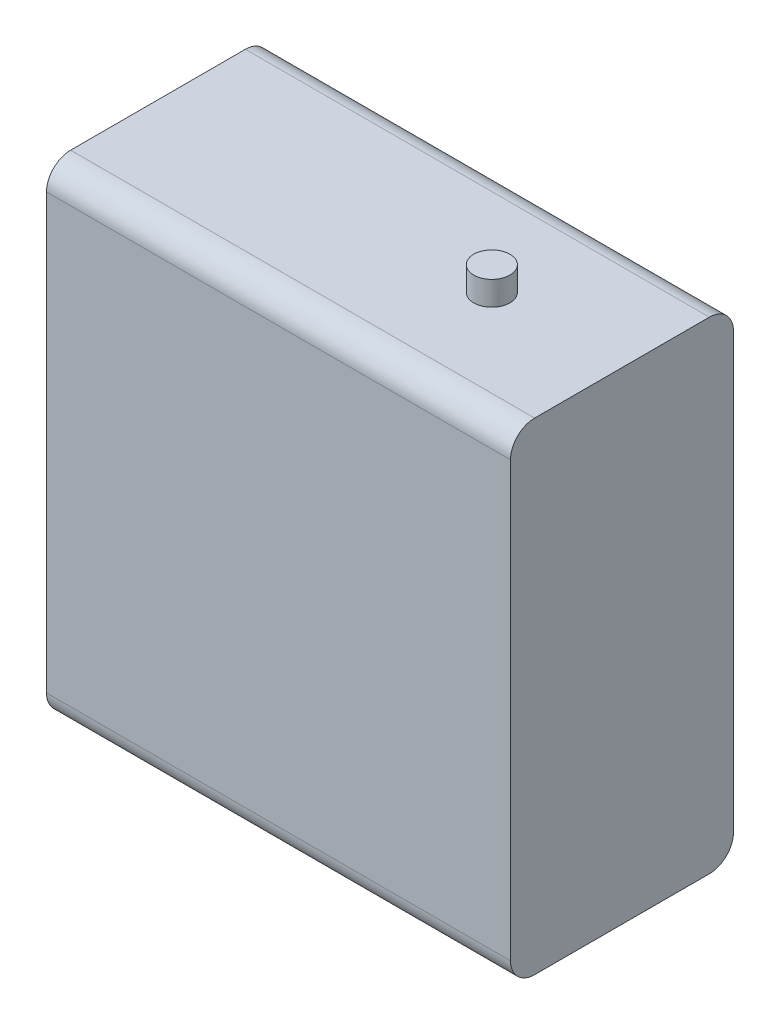
ISO-10303-21;
HEADER;
FILE_DESCRIPTION(('STEP AP214'),'2;1');
FILE_NAME('part.step','',(''),(''),'','','');
FILE_SCHEMA(('AUTOMOTIVE_DESIGN { 1 0 10303 214 1 1 1 1 }'));
ENDSEC;
DATA;
#1=APPLICATION_CONTEXT('core data for automotive mechanical design processes');
#2=APPLICATION_PROTOCOL_DEFINITION('international standard','automotive_design',2000,#1);
#3=PRODUCT_CONTEXT('',#1,'mechanical');
#4=PRODUCT('Part','Part','',(#3));
#5=PRODUCT_RELATED_PRODUCT_CATEGORY('part','',(#4));
#6=PRODUCT_DEFINITION_FORMATION('','',#4);
#7=PRODUCT_DEFINITION_CONTEXT('part definition',#1,'design');
#8=PRODUCT_DEFINITION('design','',#6,#7);
#9=PRODUCT_DEFINITION_SHAPE('','',#8);
#10=(LENGTH_UNIT() NAMED_UNIT(*) SI_UNIT(.MILLI.,.METRE.));
#11=(NAMED_UNIT(*) PLANE_ANGLE_UNIT() SI_UNIT($,.RADIAN.));
#12=(NAMED_UNIT(*) SI_UNIT($,.STERADIAN.) SOLID_ANGLE_UNIT());
#13=UNCERTAINTY_MEASURE_WITH_UNIT(LENGTH_MEASURE(1.E-05),#10,'distance_accuracy_value','');
#14=(GEOMETRIC_REPRESENTATION_CONTEXT(3) GLOBAL_UNCERTAINTY_ASSIGNED_CONTEXT((#13)) GLOBAL_UNIT_ASSIGNED_CONTEXT((#10,
#11,#12)) REPRESENTATION_CONTEXT('',''));
#15=CARTESIAN_POINT('',(0.,0.,0.));
#16=DIRECTION('',(0.,0.,1.));
#17=DIRECTION('',(1.,0.,0.));
#18=AXIS2_PLACEMENT_3D('',#15,#16,#17);
#19=CARTESIAN_POINT('',(0.,0.,18.5));
#20=DIRECTION('',(1.,0.,0.));
#21=DIRECTION('',(0.,0.,-1.));
#22=AXIS2_PLACEMENT_3D('',#19,#20,#21);
#23=PLANE('',#22);
#24=DIRECTION('',(0.,-1.,0.));
#25=VECTOR('',#24,1.);
#26=CARTESIAN_POINT('',(0.,0.,0.));
#27=LINE('',#26,#25);
#28=CARTESIAN_POINT('',(0.,38.,0.));
#29=VERTEX_POINT('',#28);
#30=CARTESIAN_POINT('',(0.,2.,0.));
#31=VERTEX_POINT('',#30);
#32=EDGE_CURVE('E173',#29,#31,#27,.T.);
#33=ORIENTED_EDGE('',*,*,#32,.T.);
#34=CARTESIAN_POINT('',(0.,2.,2.));
#35=DIRECTION('',(1.,0.,0.));
#36=DIRECTION('',(0.,0.,-1.));
#37=AXIS2_PLACEMENT_3D('',#34,#35,#36);
#38=CIRCLE('',#37,2.);
#39=CARTESIAN_POINT('',(0.,0.,2.));
#40=VERTEX_POINT('',#39);
#41=EDGE_CURVE('E144',#31,#40,#38,.F.);
#42=ORIENTED_EDGE('',*,*,#41,.T.);
#43=DIRECTION('',(0.,0.,-1.));
#44=VECTOR('',#43,1.);
#45=CARTESIAN_POINT('',(0.,0.,18.5));
#46=LINE('',#45,#44);
#47=CARTESIAN_POINT('',(0.,0.,16.5));
#48=VERTEX_POINT('',#47);
#49=EDGE_CURVE('E123',#48,#40,#46,.T.);
#50=ORIENTED_EDGE('',*,*,#49,.F.);
#51=CARTESIAN_POINT('',(0.,2.,16.5));
#52=DIRECTION('',(1.,0.,0.));
#53=DIRECTION('',(0.,0.,-1.));
#54=AXIS2_PLACEMENT_3D('',#51,#52,#53);
#55=CIRCLE('',#54,2.);
#56=CARTESIAN_POINT('',(0.,2.,18.5));
#57=VERTEX_POINT('',#56);
#58=EDGE_CURVE('E128',#48,#57,#55,.F.);
#59=ORIENTED_EDGE('',*,*,#58,.T.);
#60=DIRECTION('',(0.,-1.,0.));
#61=VECTOR('',#60,1.);
#62=CARTESIAN_POINT('',(0.,0.,18.5));
#63=LINE('',#62,#61);
#64=CARTESIAN_POINT('',(0.,38.,18.5));
#65=VERTEX_POINT('',#64);
#66=EDGE_CURVE('E168',#65,#57,#63,.T.);
#67=ORIENTED_EDGE('',*,*,#66,.F.);
#68=CARTESIAN_POINT('',(0.,38.,16.5));
#69=DIRECTION('',(1.,0.,0.));
#70=DIRECTION('',(0.,0.,-1.));
#71=AXIS2_PLACEMENT_3D('',#68,#69,#70);
#72=CIRCLE('',#71,2.);
#73=CARTESIAN_POINT('',(0.,40.,16.5));
#74=VERTEX_POINT('',#73);
#75=EDGE_CURVE('E58',#65,#74,#72,.F.);
#76=ORIENTED_EDGE('',*,*,#75,.T.);
#77=DIRECTION('',(0.,0.,-1.));
#78=VECTOR('',#77,1.);
#79=CARTESIAN_POINT('',(0.,40.,18.5));
#80=LINE('',#79,#78);
#81=CARTESIAN_POINT('',(0.,40.,2.));
#82=VERTEX_POINT('',#81);
#83=EDGE_CURVE('E157',#74,#82,#80,.T.);
#84=ORIENTED_EDGE('',*,*,#83,.T.);
#85=CARTESIAN_POINT('',(0.,38.,2.));
#86=DIRECTION('',(1.,0.,0.));
#87=DIRECTION('',(0.,0.,-1.));
#88=AXIS2_PLACEMENT_3D('',#85,#86,#87);
#89=CIRCLE('',#88,2.);
#90=EDGE_CURVE('E50',#82,#29,#89,.F.);
#91=ORIENTED_EDGE('',*,*,#90,.T.);
#92=EDGE_LOOP('',(#33,#42,#50,#59,#67,#76,#84,#91));
#93=FACE_BOUND('',#92,.T.);
#94=ADVANCED_FACE('F35',(#93),#23,.F.);
#95=CARTESIAN_POINT('',(0.,0.,18.5));
#96=DIRECTION('',(0.,1.,0.));
#97=DIRECTION('',(0.,0.,1.));
#98=AXIS2_PLACEMENT_3D('',#95,#96,#97);
#99=PLANE('',#98);
#100=ORIENTED_EDGE('',*,*,#49,.T.);
#101=DIRECTION('',(1.,0.,0.));
#102=VECTOR('',#101,1.);
#103=CARTESIAN_POINT('',(38.5,0.,2.));
#104=LINE('',#103,#102);
#105=CARTESIAN_POINT('',(38.5,0.,2.));
#106=VERTEX_POINT('',#105);
#107=EDGE_CURVE('E122',#40,#106,#104,.T.);
#108=ORIENTED_EDGE('',*,*,#107,.T.);
#109=DIRECTION('',(0.,0.,-1.));
#110=VECTOR('',#109,1.);
#111=CARTESIAN_POINT('',(38.5,0.,18.5));
#112=LINE('',#111,#110);
#113=CARTESIAN_POINT('',(38.5,0.,16.5));
#114=VERTEX_POINT('',#113);
#115=EDGE_CURVE('E105',#114,#106,#112,.T.);
#116=ORIENTED_EDGE('',*,*,#115,.F.);
#117=DIRECTION('',(1.,0.,0.));
#118=VECTOR('',#117,1.);
#119=CARTESIAN_POINT('',(0.,0.,16.5));
#120=LINE('',#119,#118);
#121=EDGE_CURVE('E119',#114,#48,#120,.F.);
#122=ORIENTED_EDGE('',*,*,#121,.T.);
#123=EDGE_LOOP('',(#100,#108,#116,#122));
#124=FACE_BOUND('',#123,.T.);
#125=ADVANCED_FACE('F118',(#124),#99,.F.);
#126=CARTESIAN_POINT('',(38.5,0.,18.5));
#127=DIRECTION('',(-1.,0.,0.));
#128=DIRECTION('',(0.,0.,1.));
#129=AXIS2_PLACEMENT_3D('',#126,#127,#128);
#130=PLANE('',#129);
#131=ORIENTED_EDGE('',*,*,#115,.T.);
#132=CARTESIAN_POINT('',(38.5,2.,2.));
#133=DIRECTION('',(-1.,0.,0.));
#134=DIRECTION('',(0.,0.,1.));
#135=AXIS2_PLACEMENT_3D('',#132,#133,#134);
#136=CIRCLE('',#135,2.);
#137=CARTESIAN_POINT('',(38.5,2.,0.));
#138=VERTEX_POINT('',#137);
#139=EDGE_CURVE('E112',#106,#138,#136,.F.);
#140=ORIENTED_EDGE('',*,*,#139,.T.);
#141=DIRECTION('',(0.,1.,0.));
#142=VECTOR('',#141,1.);
#143=CARTESIAN_POINT('',(38.5,0.,0.));
#144=LINE('',#143,#142);
#145=CARTESIAN_POINT('',(38.5,38.,0.));
#146=VERTEX_POINT('',#145);
#147=EDGE_CURVE('E170',#138,#146,#144,.T.);
#148=ORIENTED_EDGE('',*,*,#147,.T.);
#149=CARTESIAN_POINT('',(38.5,38.,2.));
#150=DIRECTION('',(-1.,0.,0.));
#151=DIRECTION('',(0.,0.,1.));
#152=AXIS2_PLACEMENT_3D('',#149,#150,#151);
#153=CIRCLE('',#152,2.);
#154=CARTESIAN_POINT('',(38.5,40.,2.));
#155=VERTEX_POINT('',#154);
#156=EDGE_CURVE('E130',#146,#155,#153,.F.);
#157=ORIENTED_EDGE('',*,*,#156,.T.);
#158=DIRECTION('',(0.,0.,-1.));
#159=VECTOR('',#158,1.);
#160=CARTESIAN_POINT('',(38.5,40.,18.5));
#161=LINE('',#160,#159);
#162=CARTESIAN_POINT('',(38.5,40.,16.5));
#163=VERTEX_POINT('',#162);
#164=EDGE_CURVE('E124',#163,#155,#161,.T.);
#165=ORIENTED_EDGE('',*,*,#164,.F.);
#166=CARTESIAN_POINT('',(38.5,38.,16.5));
#167=DIRECTION('',(-1.,0.,0.));
#168=DIRECTION('',(0.,0.,1.));
#169=AXIS2_PLACEMENT_3D('',#166,#167,#168);
#170=CIRCLE('',#169,2.);
#171=CARTESIAN_POINT('',(38.5,38.,18.5));
#172=VERTEX_POINT('',#171);
#173=EDGE_CURVE('E113',#163,#172,#170,.F.);
#174=ORIENTED_EDGE('',*,*,#173,.T.);
#175=DIRECTION('',(0.,1.,0.));
#176=VECTOR('',#175,1.);
#177=CARTESIAN_POINT('',(38.5,0.,18.5));
#178=LINE('',#177,#176);
#179=CARTESIAN_POINT('',(38.5,2.,18.5));
#180=VERTEX_POINT('',#179);
#181=EDGE_CURVE('E107',#180,#172,#178,.T.);
#182=ORIENTED_EDGE('',*,*,#181,.F.);
#183=CARTESIAN_POINT('',(38.5,2.,16.5));
#184=DIRECTION('',(-1.,0.,0.));
#185=DIRECTION('',(0.,0.,1.));
#186=AXIS2_PLACEMENT_3D('',#183,#184,#185);
#187=CIRCLE('',#186,2.);
#188=EDGE_CURVE('E102',#180,#114,#187,.F.);
#189=ORIENTED_EDGE('',*,*,#188,.T.);
#190=EDGE_LOOP('',(#131,#140,#148,#157,#165,#174,#182,#189));
#191=FACE_BOUND('',#190,.T.);
#192=ADVANCED_FACE('F104',(#191),#130,.F.);
#193=CARTESIAN_POINT('',(0.,40.,18.5));
#194=DIRECTION('',(0.,-1.,0.));
#195=DIRECTION('',(0.,0.,-1.));
#196=AXIS2_PLACEMENT_3D('',#193,#194,#195);
#197=PLANE('',#196);
#198=CARTESIAN_POINT('',(27.7,40.,9.25));
#199=DIRECTION('',(0.,-1.,0.));
#200=DIRECTION('',(0.,0.,-1.));
#201=AXIS2_PLACEMENT_3D('',#198,#199,#200);
#202=CIRCLE('',#201,1.5);
#203=CARTESIAN_POINT('',(27.7,40.,7.75));
#204=VERTEX_POINT('',#203);
#205=EDGE_CURVE('E11',#204,#204,#202,.F.);
#206=ORIENTED_EDGE('',*,*,#205,.F.);
#207=EDGE_LOOP('',(#206));
#208=FACE_BOUND('',#207,.T.);
#209=ORIENTED_EDGE('',*,*,#83,.F.);
#210=DIRECTION('',(-1.,0.,0.));
#211=VECTOR('',#210,1.);
#212=CARTESIAN_POINT('',(0.,40.,16.5));
#213=LINE('',#212,#211);
#214=EDGE_CURVE('E43',#74,#163,#213,.F.);
#215=ORIENTED_EDGE('',*,*,#214,.T.);
#216=ORIENTED_EDGE('',*,*,#164,.T.);
#217=DIRECTION('',(-1.,0.,0.));
#218=VECTOR('',#217,1.);
#219=CARTESIAN_POINT('',(0.,40.,2.));
#220=LINE('',#219,#218);
#221=EDGE_CURVE('E151',#155,#82,#220,.T.);
#222=ORIENTED_EDGE('',*,*,#221,.T.);
#223=EDGE_LOOP('',(#209,#215,#216,#222));
#224=FACE_BOUND('',#223,.T.);
#225=ADVANCED_FACE('F156',(#208,#224),#197,.F.);
#226=CARTESIAN_POINT('',(0.,0.,18.5));
#227=DIRECTION('',(0.,0.,-1.));
#228=DIRECTION('',(-1.,0.,0.));
#229=AXIS2_PLACEMENT_3D('',#226,#227,#228);
#230=PLANE('',#229);
#231=ORIENTED_EDGE('',*,*,#66,.T.);
#232=DIRECTION('',(1.,0.,0.));
#233=VECTOR('',#232,1.);
#234=CARTESIAN_POINT('',(0.,2.,18.5));
#235=LINE('',#234,#233);
#236=EDGE_CURVE('E149',#57,#180,#235,.T.);
#237=ORIENTED_EDGE('',*,*,#236,.T.);
#238=ORIENTED_EDGE('',*,*,#181,.T.);
#239=DIRECTION('',(-1.,0.,0.));
#240=VECTOR('',#239,1.);
#241=CARTESIAN_POINT('',(0.,38.,18.5));
#242=LINE('',#241,#240);
#243=EDGE_CURVE('E146',#172,#65,#242,.T.);
#244=ORIENTED_EDGE('',*,*,#243,.T.);
#245=EDGE_LOOP('',(#231,#237,#238,#244));
#246=FACE_BOUND('',#245,.T.);
#247=ADVANCED_FACE('F167',(#246),#230,.F.);
#248=CARTESIAN_POINT('',(0.,0.,0.));
#249=DIRECTION('',(0.,0.,-1.));
#250=DIRECTION('',(-1.,0.,0.));
#251=AXIS2_PLACEMENT_3D('',#248,#249,#250);
#252=PLANE('',#251);
#253=ORIENTED_EDGE('',*,*,#147,.F.);
#254=DIRECTION('',(1.,0.,0.));
#255=VECTOR('',#254,1.);
#256=CARTESIAN_POINT('',(0.,2.,0.));
#257=LINE('',#256,#255);
#258=EDGE_CURVE('E139',#138,#31,#257,.F.);
#259=ORIENTED_EDGE('',*,*,#258,.T.);
#260=ORIENTED_EDGE('',*,*,#32,.F.);
#261=DIRECTION('',(-1.,0.,0.));
#262=VECTOR('',#261,1.);
#263=CARTESIAN_POINT('',(38.5,38.,0.));
#264=LINE('',#263,#262);
#265=EDGE_CURVE('E137',#29,#146,#264,.F.);
#266=ORIENTED_EDGE('',*,*,#265,.T.);
#267=EDGE_LOOP('',(#253,#259,#260,#266));
#268=FACE_BOUND('',#267,.T.);
#269=ADVANCED_FACE('F183',(#268),#252,.T.);
#270=CARTESIAN_POINT('',(0.,2.,2.));
#271=DIRECTION('',(-1.,0.,0.));
#272=DIRECTION('',(0.,0.,1.));
#273=AXIS2_PLACEMENT_3D('',#270,#271,#272);
#274=CYLINDRICAL_SURFACE('',#273,2.);
#275=ORIENTED_EDGE('',*,*,#41,.F.);
#276=ORIENTED_EDGE('',*,*,#258,.F.);
#277=ORIENTED_EDGE('',*,*,#139,.F.);
#278=ORIENTED_EDGE('',*,*,#107,.F.);
#279=EDGE_LOOP('',(#275,#276,#277,#278));
#280=FACE_BOUND('',#279,.T.);
#281=ADVANCED_FACE('F202',(#280),#274,.T.);
#282=CARTESIAN_POINT('',(0.,2.,16.5));
#283=DIRECTION('',(1.,0.,0.));
#284=DIRECTION('',(0.,0.,-1.));
#285=AXIS2_PLACEMENT_3D('',#282,#283,#284);
#286=CYLINDRICAL_SURFACE('',#285,2.);
#287=ORIENTED_EDGE('',*,*,#58,.F.);
#288=ORIENTED_EDGE('',*,*,#121,.F.);
#289=ORIENTED_EDGE('',*,*,#188,.F.);
#290=ORIENTED_EDGE('',*,*,#236,.F.);
#291=EDGE_LOOP('',(#287,#288,#289,#290));
#292=FACE_BOUND('',#291,.T.);
#293=ADVANCED_FACE('F127',(#292),#286,.T.);
#294=CARTESIAN_POINT('',(0.,38.,16.5));
#295=DIRECTION('',(-1.,0.,0.));
#296=DIRECTION('',(0.,0.,1.));
#297=AXIS2_PLACEMENT_3D('',#294,#295,#296);
#298=CYLINDRICAL_SURFACE('',#297,2.);
#299=ORIENTED_EDGE('',*,*,#173,.F.);
#300=ORIENTED_EDGE('',*,*,#214,.F.);
#301=ORIENTED_EDGE('',*,*,#75,.F.);
#302=ORIENTED_EDGE('',*,*,#243,.F.);
#303=EDGE_LOOP('',(#299,#300,#301,#302));
#304=FACE_BOUND('',#303,.T.);
#305=ADVANCED_FACE('F164',(#304),#298,.T.);
#306=CARTESIAN_POINT('',(0.,38.,2.));
#307=DIRECTION('',(1.,0.,0.));
#308=DIRECTION('',(0.,0.,-1.));
#309=AXIS2_PLACEMENT_3D('',#306,#307,#308);
#310=CYLINDRICAL_SURFACE('',#309,2.);
#311=ORIENTED_EDGE('',*,*,#156,.F.);
#312=ORIENTED_EDGE('',*,*,#265,.F.);
#313=ORIENTED_EDGE('',*,*,#90,.F.);
#314=ORIENTED_EDGE('',*,*,#221,.F.);
#315=EDGE_LOOP('',(#311,#312,#313,#314));
#316=FACE_BOUND('',#315,.T.);
#317=ADVANCED_FACE('F37',(#316),#310,.T.);
#318=CARTESIAN_POINT('',(27.7,42.,9.25));
#319=DIRECTION('',(0.,-1.,0.));
#320=DIRECTION('',(0.,0.,-1.));
#321=AXIS2_PLACEMENT_3D('',#318,#319,#320);
#322=CYLINDRICAL_SURFACE('',#321,1.5);
#323=CARTESIAN_POINT('',(27.7,42.,9.25));
#324=DIRECTION('',(0.,1.,0.));
#325=DIRECTION('',(0.,0.,1.));
#326=AXIS2_PLACEMENT_3D('',#323,#324,#325);
#327=CIRCLE('',#326,1.5);
#328=CARTESIAN_POINT('',(27.7,42.,10.75));
#329=VERTEX_POINT('',#328);
#330=EDGE_CURVE('E176',#329,#329,#327,.T.);
#331=ORIENTED_EDGE('',*,*,#330,.F.);
#332=EDGE_LOOP('',(#331));
#333=FACE_BOUND('',#332,.T.);
#334=ORIENTED_EDGE('',*,*,#205,.T.);
#335=EDGE_LOOP('',(#334));
#336=FACE_BOUND('',#335,.T.);
#337=ADVANCED_FACE('F186',(#333,#336),#322,.T.);
#338=CARTESIAN_POINT('',(27.7,42.,9.25));
#339=DIRECTION('',(0.,1.,0.));
#340=DIRECTION('',(0.,0.,1.));
#341=AXIS2_PLACEMENT_3D('',#338,#339,#340);
#342=PLANE('',#341);
#343=ORIENTED_EDGE('',*,*,#330,.T.);
#344=EDGE_LOOP('',(#343));
#345=FACE_BOUND('',#344,.T.);
#346=ADVANCED_FACE('F191',(#345),#342,.T.);
#347=CLOSED_SHELL('',(#94,#125,#192,#225,#247,#269,#281,#293,#305,#317,#337,#346));
#348=MANIFOLD_SOLID_BREP('B2',#347);
#349=ADVANCED_BREP_SHAPE_REPRESENTATION('',(#18,#348),#14);
#350=SHAPE_DEFINITION_REPRESENTATION(#9,#349);
ENDSEC;
END-ISO-10303-21;
